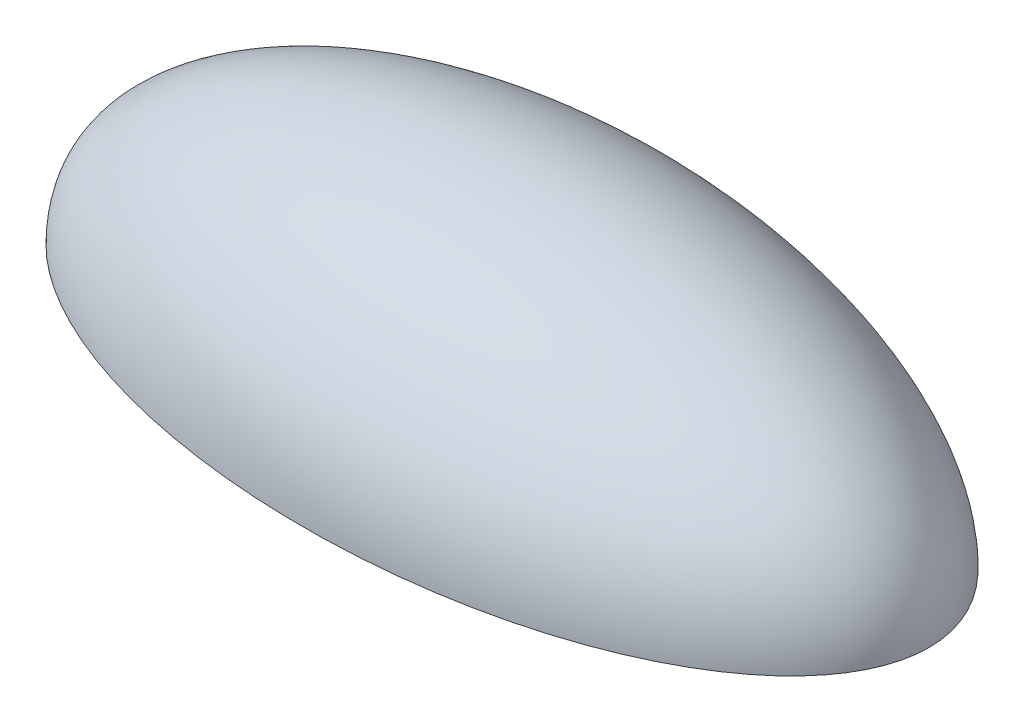
ISO-10303-21;
HEADER;
FILE_DESCRIPTION(('STEP AP214'),'2;1');
FILE_NAME('part.step','',(''),(''),'','','');
FILE_SCHEMA(('AUTOMOTIVE_DESIGN { 1 0 10303 214 1 1 1 1 }'));
ENDSEC;
DATA;
#1=APPLICATION_CONTEXT('core data for automotive mechanical design processes');
#2=APPLICATION_PROTOCOL_DEFINITION('international standard','automotive_design',2000,#1);
#3=PRODUCT_CONTEXT('',#1,'mechanical');
#4=PRODUCT('Part','Part','',(#3));
#5=PRODUCT_RELATED_PRODUCT_CATEGORY('part','',(#4));
#6=PRODUCT_DEFINITION_FORMATION('','',#4);
#7=PRODUCT_DEFINITION_CONTEXT('part definition',#1,'design');
#8=PRODUCT_DEFINITION('design','',#6,#7);
#9=PRODUCT_DEFINITION_SHAPE('','',#8);
#10=(LENGTH_UNIT() NAMED_UNIT(*) SI_UNIT(.MILLI.,.METRE.));
#11=(NAMED_UNIT(*) PLANE_ANGLE_UNIT() SI_UNIT($,.RADIAN.));
#12=(NAMED_UNIT(*) SI_UNIT($,.STERADIAN.) SOLID_ANGLE_UNIT());
#13=UNCERTAINTY_MEASURE_WITH_UNIT(LENGTH_MEASURE(1.E-05),#10,'distance_accuracy_value','');
#14=(GEOMETRIC_REPRESENTATION_CONTEXT(3) GLOBAL_UNCERTAINTY_ASSIGNED_CONTEXT((#13)) GLOBAL_UNIT_ASSIGNED_CONTEXT((#10,
#11,#12)) REPRESENTATION_CONTEXT('',''));
#15=CARTESIAN_POINT('',(0.,0.,0.));
#16=DIRECTION('',(0.,0.,1.));
#17=DIRECTION('',(1.,0.,0.));
#18=AXIS2_PLACEMENT_3D('',#15,#16,#17);
#19=CARTESIAN_POINT('',(0.,0.,0.));
#20=DIRECTION('',(0.,-1.,0.));
#21=DIRECTION('',(-1.,0.,0.));
#22=AXIS2_PLACEMENT_3D('',#19,#20,#21);
#23=ELLIPSE('',#22,12.,6.);
#24=TRIMMED_CURVE('',#23,(PARAMETER_VALUE(3.14159265358979)),
(PARAMETER_VALUE(6.28318530717959)),.T.,.PARAMETER.);
#25=CARTESIAN_POINT('',(-12.,0.,0.));
#26=DIRECTION('',(-1.,0.,0.));
#27=AXIS1_PLACEMENT('',#25,#26);
#28=SURFACE_OF_REVOLUTION('',#24,#27);
#29=CARTESIAN_POINT('',(0.,0.,0.));
#30=DIRECTION('',(0.,1.,0.));
#31=DIRECTION('',(-1.,0.,0.));
#32=AXIS2_PLACEMENT_3D('',#29,#30,#31);
#33=ELLIPSE('',#32,12.,6.);
#34=CARTESIAN_POINT('',(12.,0.,0.));
#35=VERTEX_POINT('',#34);
#36=CARTESIAN_POINT('',(-12.,0.,0.));
#37=VERTEX_POINT('',#36);
#38=EDGE_CURVE('E40',#35,#37,#33,.T.);
#39=ORIENTED_EDGE('',*,*,#38,.T.);
#40=EDGE_CURVE('E11',#35,#37,#23,.T.);
#41=ORIENTED_EDGE('',*,*,#40,.F.);
#42=EDGE_LOOP('',(#39,#41));
#43=FACE_BOUND('',#42,.T.);
#44=ADVANCED_FACE('F32',(#43),#28,.T.);
#45=CARTESIAN_POINT('',(0.,0.,0.));
#46=DIRECTION('',(0.,-1.,0.));
#47=DIRECTION('',(0.,0.,-1.));
#48=AXIS2_PLACEMENT_3D('',#45,#46,#47);
#49=PLANE('',#48);
#50=ORIENTED_EDGE('',*,*,#40,.T.);
#51=ORIENTED_EDGE('',*,*,#38,.F.);
#52=EDGE_LOOP('',(#50,#51));
#53=FACE_BOUND('',#52,.T.);
#54=ADVANCED_FACE('F47',(#53),#49,.T.);
#55=CLOSED_SHELL('',(#44,#54));
#56=MANIFOLD_SOLID_BREP('B2',#55);
#57=ADVANCED_BREP_SHAPE_REPRESENTATION('',(#18,#56),#14);
#58=SHAPE_DEFINITION_REPRESENTATION(#9,#57);
ENDSEC;
END-ISO-10303-21;
